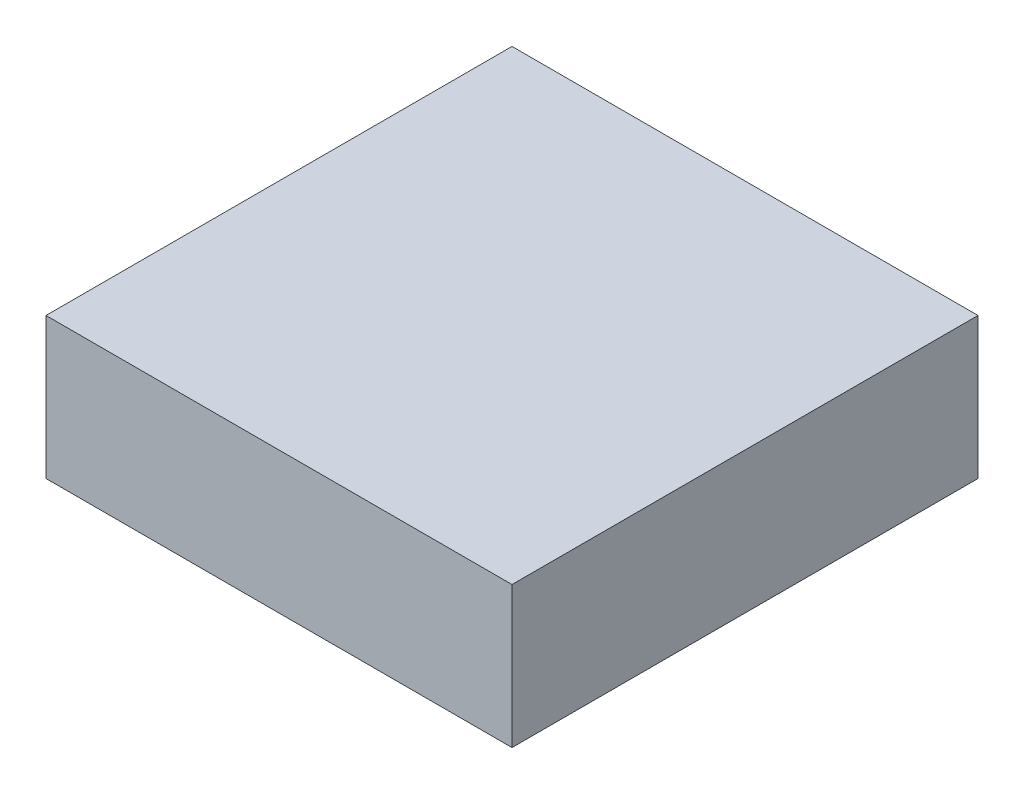
ISO-10303-21;
HEADER;
FILE_DESCRIPTION(('STEP AP214'),'2;1');
FILE_NAME('part.step','',(''),(''),'','','');
FILE_SCHEMA(('AUTOMOTIVE_DESIGN { 1 0 10303 214 1 1 1 1 }'));
ENDSEC;
DATA;
#1=APPLICATION_CONTEXT('core data for automotive mechanical design processes');
#2=APPLICATION_PROTOCOL_DEFINITION('international standard','automotive_design',2000,#1);
#3=PRODUCT_CONTEXT('',#1,'mechanical');
#4=PRODUCT('Part','Part','',(#3));
#5=PRODUCT_RELATED_PRODUCT_CATEGORY('part','',(#4));
#6=PRODUCT_DEFINITION_FORMATION('','',#4);
#7=PRODUCT_DEFINITION_CONTEXT('part definition',#1,'design');
#8=PRODUCT_DEFINITION('design','',#6,#7);
#9=PRODUCT_DEFINITION_SHAPE('','',#8);
#10=(LENGTH_UNIT() NAMED_UNIT(*) SI_UNIT(.MILLI.,.METRE.));
#11=(NAMED_UNIT(*) PLANE_ANGLE_UNIT() SI_UNIT($,.RADIAN.));
#12=(NAMED_UNIT(*) SI_UNIT($,.STERADIAN.) SOLID_ANGLE_UNIT());
#13=UNCERTAINTY_MEASURE_WITH_UNIT(LENGTH_MEASURE(1.E-05),#10,'distance_accuracy_value','');
#14=(GEOMETRIC_REPRESENTATION_CONTEXT(3) GLOBAL_UNCERTAINTY_ASSIGNED_CONTEXT((#13)) GLOBAL_UNIT_ASSIGNED_CONTEXT((#10,
#11,#12)) REPRESENTATION_CONTEXT('',''));
#15=CARTESIAN_POINT('',(0.,0.,0.));
#16=DIRECTION('',(0.,0.,1.));
#17=DIRECTION('',(1.,0.,0.));
#18=AXIS2_PLACEMENT_3D('',#15,#16,#17);
#19=CARTESIAN_POINT('',(33.85,-1.85,-11.525));
#20=DIRECTION('',(0.,-1.,0.));
#21=DIRECTION('',(1.,0.,0.));
#22=AXIS2_PLACEMENT_3D('',#19,#20,#21);
#23=PLANE('',#22);
#24=DIRECTION('',(1.,0.,0.));
#25=VECTOR('',#24,1.);
#26=CARTESIAN_POINT('',(35.5,-1.85,-8.225));
#27=LINE('',#26,#25);
#28=CARTESIAN_POINT('',(33.85,-1.85,-8.225));
#29=VERTEX_POINT('',#28);
#30=CARTESIAN_POINT('',(37.15,-1.85,-8.225));
#31=VERTEX_POINT('',#30);
#32=EDGE_CURVE('E54',#29,#31,#27,.T.);
#33=ORIENTED_EDGE('',*,*,#32,.F.);
#34=DIRECTION('',(0.,0.,1.));
#35=VECTOR('',#34,1.);
#36=CARTESIAN_POINT('',(33.85,-1.85,-9.875));
#37=LINE('',#36,#35);
#38=CARTESIAN_POINT('',(33.85,-1.85,-11.525));
#39=VERTEX_POINT('',#38);
#40=EDGE_CURVE('E69',#39,#29,#37,.T.);
#41=ORIENTED_EDGE('',*,*,#40,.F.);
#42=DIRECTION('',(-1.,0.,0.));
#43=VECTOR('',#42,1.);
#44=CARTESIAN_POINT('',(35.5,-1.85,-11.525));
#45=LINE('',#44,#43);
#46=CARTESIAN_POINT('',(37.15,-1.85,-11.525));
#47=VERTEX_POINT('',#46);
#48=EDGE_CURVE('E21',#47,#39,#45,.T.);
#49=ORIENTED_EDGE('',*,*,#48,.F.);
#50=DIRECTION('',(0.,0.,-1.));
#51=VECTOR('',#50,1.);
#52=CARTESIAN_POINT('',(37.15,-1.85,-9.875));
#53=LINE('',#52,#51);
#54=EDGE_CURVE('E59',#31,#47,#53,.T.);
#55=ORIENTED_EDGE('',*,*,#54,.F.);
#56=EDGE_LOOP('',(#33,#41,#49,#55));
#57=FACE_BOUND('',#56,.T.);
#58=ADVANCED_FACE('F17',(#57),#23,.T.);
#59=CARTESIAN_POINT('',(33.85,-0.85,-11.525));
#60=DIRECTION('',(0.,0.,-1.));
#61=DIRECTION('',(1.,0.,0.));
#62=AXIS2_PLACEMENT_3D('',#59,#60,#61);
#63=PLANE('',#62);
#64=ORIENTED_EDGE('',*,*,#48,.T.);
#65=DIRECTION('',(0.,-1.,0.));
#66=VECTOR('',#65,1.);
#67=CARTESIAN_POINT('',(33.85,-1.35,-11.525));
#68=LINE('',#67,#66);
#69=CARTESIAN_POINT('',(33.85,-0.85,-11.525));
#70=VERTEX_POINT('',#69);
#71=EDGE_CURVE('E80',#70,#39,#68,.T.);
#72=ORIENTED_EDGE('',*,*,#71,.F.);
#73=DIRECTION('',(1.,0.,0.));
#74=VECTOR('',#73,1.);
#75=CARTESIAN_POINT('',(35.5,-0.85,-11.525));
#76=LINE('',#75,#74);
#77=CARTESIAN_POINT('',(37.15,-0.85,-11.525));
#78=VERTEX_POINT('',#77);
#79=EDGE_CURVE('E75',#70,#78,#76,.T.);
#80=ORIENTED_EDGE('',*,*,#79,.T.);
#81=DIRECTION('',(0.,1.,0.));
#82=VECTOR('',#81,1.);
#83=CARTESIAN_POINT('',(37.15,-1.35,-11.525));
#84=LINE('',#83,#82);
#85=EDGE_CURVE('E64',#47,#78,#84,.T.);
#86=ORIENTED_EDGE('',*,*,#85,.F.);
#87=EDGE_LOOP('',(#64,#72,#80,#86));
#88=FACE_BOUND('',#87,.T.);
#89=ADVANCED_FACE('F74',(#88),#63,.T.);
#90=CARTESIAN_POINT('',(37.15,-0.85,-11.525));
#91=DIRECTION('',(1.,0.,0.));
#92=DIRECTION('',(0.,0.,1.));
#93=AXIS2_PLACEMENT_3D('',#90,#91,#92);
#94=PLANE('',#93);
#95=ORIENTED_EDGE('',*,*,#54,.T.);
#96=ORIENTED_EDGE('',*,*,#85,.T.);
#97=DIRECTION('',(0.,0.,1.));
#98=VECTOR('',#97,1.);
#99=CARTESIAN_POINT('',(37.15,-0.85,-9.875));
#100=LINE('',#99,#98);
#101=CARTESIAN_POINT('',(37.15,-0.85,-8.225));
#102=VERTEX_POINT('',#101);
#103=EDGE_CURVE('E85',#78,#102,#100,.T.);
#104=ORIENTED_EDGE('',*,*,#103,.T.);
#105=DIRECTION('',(0.,1.,0.));
#106=VECTOR('',#105,1.);
#107=CARTESIAN_POINT('',(37.15,-1.35,-8.225));
#108=LINE('',#107,#106);
#109=EDGE_CURVE('E66',#31,#102,#108,.T.);
#110=ORIENTED_EDGE('',*,*,#109,.F.);
#111=EDGE_LOOP('',(#95,#96,#104,#110));
#112=FACE_BOUND('',#111,.T.);
#113=ADVANCED_FACE('F61',(#112),#94,.T.);
#114=CARTESIAN_POINT('',(37.15,-0.85,-8.225));
#115=DIRECTION('',(0.,0.,1.));
#116=DIRECTION('',(-1.,0.,0.));
#117=AXIS2_PLACEMENT_3D('',#114,#115,#116);
#118=PLANE('',#117);
#119=ORIENTED_EDGE('',*,*,#32,.T.);
#120=ORIENTED_EDGE('',*,*,#109,.T.);
#121=DIRECTION('',(-1.,0.,0.));
#122=VECTOR('',#121,1.);
#123=CARTESIAN_POINT('',(35.5,-0.85,-8.225));
#124=LINE('',#123,#122);
#125=CARTESIAN_POINT('',(33.85,-0.85,-8.225));
#126=VERTEX_POINT('',#125);
#127=EDGE_CURVE('E27',#102,#126,#124,.T.);
#128=ORIENTED_EDGE('',*,*,#127,.T.);
#129=DIRECTION('',(0.,1.,0.));
#130=VECTOR('',#129,1.);
#131=CARTESIAN_POINT('',(33.85,-1.35,-8.225));
#132=LINE('',#131,#130);
#133=EDGE_CURVE('E35',#29,#126,#132,.T.);
#134=ORIENTED_EDGE('',*,*,#133,.F.);
#135=EDGE_LOOP('',(#119,#120,#128,#134));
#136=FACE_BOUND('',#135,.T.);
#137=ADVANCED_FACE('F89',(#136),#118,.T.);
#138=CARTESIAN_POINT('',(33.85,-0.85,-8.225));
#139=DIRECTION('',(-1.,0.,0.));
#140=DIRECTION('',(0.,0.,-1.));
#141=AXIS2_PLACEMENT_3D('',#138,#139,#140);
#142=PLANE('',#141);
#143=ORIENTED_EDGE('',*,*,#40,.T.);
#144=ORIENTED_EDGE('',*,*,#133,.T.);
#145=DIRECTION('',(0.,0.,-1.));
#146=VECTOR('',#145,1.);
#147=CARTESIAN_POINT('',(33.85,-0.85,-9.875));
#148=LINE('',#147,#146);
#149=EDGE_CURVE('E11',#126,#70,#148,.T.);
#150=ORIENTED_EDGE('',*,*,#149,.T.);
#151=ORIENTED_EDGE('',*,*,#71,.T.);
#152=EDGE_LOOP('',(#143,#144,#150,#151));
#153=FACE_BOUND('',#152,.T.);
#154=ADVANCED_FACE('F91',(#153),#142,.T.);
#155=CARTESIAN_POINT('',(33.85,-0.85,-11.525));
#156=DIRECTION('',(0.,-1.,0.));
#157=DIRECTION('',(1.,0.,0.));
#158=AXIS2_PLACEMENT_3D('',#155,#156,#157);
#159=PLANE('',#158);
#160=ORIENTED_EDGE('',*,*,#127,.F.);
#161=ORIENTED_EDGE('',*,*,#103,.F.);
#162=ORIENTED_EDGE('',*,*,#79,.F.);
#163=ORIENTED_EDGE('',*,*,#149,.F.);
#164=EDGE_LOOP('',(#160,#161,#162,#163));
#165=FACE_BOUND('',#164,.T.);
#166=ADVANCED_FACE('F19',(#165),#159,.F.);
#167=CLOSED_SHELL('',(#58,#89,#113,#137,#154,#166));
#168=MANIFOLD_SOLID_BREP('B1',#167);
#169=ADVANCED_BREP_SHAPE_REPRESENTATION('',(#18,#168),#14);
#170=SHAPE_DEFINITION_REPRESENTATION(#9,#169);
ENDSEC;
END-ISO-10303-21;
